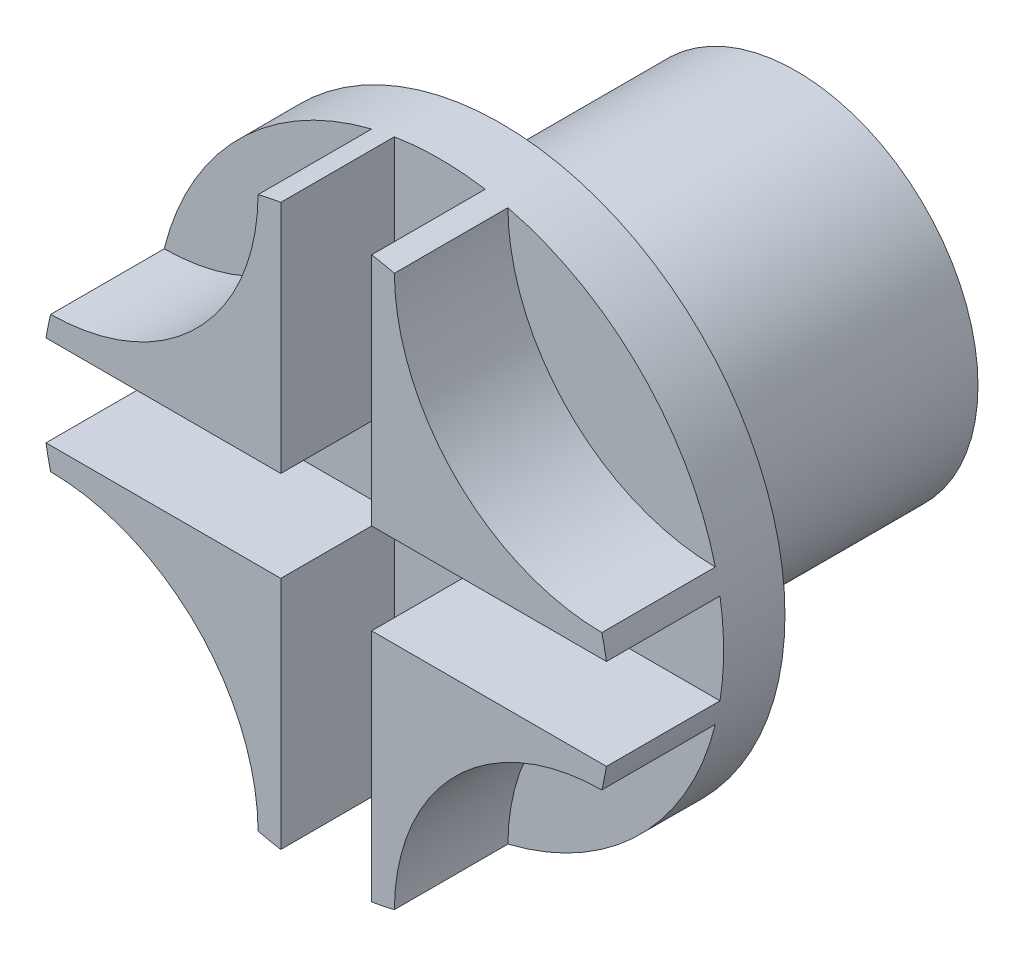
ISO-10303-21;
HEADER;
FILE_DESCRIPTION(('STEP AP214'),'2;1');
FILE_NAME('part.step','',(''),(''),'','','');
FILE_SCHEMA(('AUTOMOTIVE_DESIGN { 1 0 10303 214 1 1 1 1 }'));
ENDSEC;
DATA;
#1=APPLICATION_CONTEXT('core data for automotive mechanical design processes');
#2=APPLICATION_PROTOCOL_DEFINITION('international standard','automotive_design',2000,#1);
#3=PRODUCT_CONTEXT('',#1,'mechanical');
#4=PRODUCT('Part','Part','',(#3));
#5=PRODUCT_RELATED_PRODUCT_CATEGORY('part','',(#4));
#6=PRODUCT_DEFINITION_FORMATION('','',#4);
#7=PRODUCT_DEFINITION_CONTEXT('part definition',#1,'design');
#8=PRODUCT_DEFINITION('design','',#6,#7);
#9=PRODUCT_DEFINITION_SHAPE('','',#8);
#10=(LENGTH_UNIT() NAMED_UNIT(*) SI_UNIT(.MILLI.,.METRE.));
#11=(NAMED_UNIT(*) PLANE_ANGLE_UNIT() SI_UNIT($,.RADIAN.));
#12=(NAMED_UNIT(*) SI_UNIT($,.STERADIAN.) SOLID_ANGLE_UNIT());
#13=UNCERTAINTY_MEASURE_WITH_UNIT(LENGTH_MEASURE(1.E-05),#10,'distance_accuracy_value','');
#14=(GEOMETRIC_REPRESENTATION_CONTEXT(3) GLOBAL_UNCERTAINTY_ASSIGNED_CONTEXT((#13)) GLOBAL_UNIT_ASSIGNED_CONTEXT((#10,
#11,#12)) REPRESENTATION_CONTEXT('',''));
#15=CARTESIAN_POINT('',(0.,0.,0.));
#16=DIRECTION('',(0.,0.,1.));
#17=DIRECTION('',(1.,0.,0.));
#18=AXIS2_PLACEMENT_3D('',#15,#16,#17);
#19=CARTESIAN_POINT('',(0.,0.,2.7));
#20=DIRECTION('',(0.,0.,1.));
#21=DIRECTION('',(1.,0.,0.));
#22=AXIS2_PLACEMENT_3D('',#19,#20,#21);
#23=PLANE('',#22);
#24=DIRECTION('',(-1.,0.,0.));
#25=VECTOR('',#24,1.);
#26=CARTESIAN_POINT('',(0.,-2.,2.7));
#27=LINE('',#26,#25);
#28=CARTESIAN_POINT('',(-2.,-2.,2.7));
#29=VERTEX_POINT('',#28);
#30=CARTESIAN_POINT('',(-12.3389626792531,-2.,2.7));
#31=VERTEX_POINT('',#30);
#32=EDGE_CURVE('E49',#29,#31,#27,.T.);
#33=ORIENTED_EDGE('',*,*,#32,.F.);
#34=DIRECTION('',(0.,1.,0.));
#35=VECTOR('',#34,1.);
#36=CARTESIAN_POINT('',(-2.,0.,2.7));
#37=LINE('',#36,#35);
#38=CARTESIAN_POINT('',(-2.,-12.3389626792531,2.7));
#39=VERTEX_POINT('',#38);
#40=EDGE_CURVE('E205',#39,#29,#37,.T.);
#41=ORIENTED_EDGE('',*,*,#40,.F.);
#42=CARTESIAN_POINT('',(0.,0.,2.7));
#43=DIRECTION('',(0.,0.,1.));
#44=DIRECTION('',(1.,0.,0.));
#45=AXIS2_PLACEMENT_3D('',#42,#43,#44);
#46=CIRCLE('',#45,12.5);
#47=CARTESIAN_POINT('',(2.,-12.3389626792531,2.7));
#48=VERTEX_POINT('',#47);
#49=EDGE_CURVE('E316',#39,#48,#46,.T.);
#50=ORIENTED_EDGE('',*,*,#49,.T.);
#51=DIRECTION('',(0.,1.,0.));
#52=VECTOR('',#51,1.);
#53=CARTESIAN_POINT('',(2.,0.,2.7));
#54=LINE('',#53,#52);
#55=CARTESIAN_POINT('',(2.,-2.,2.7));
#56=VERTEX_POINT('',#55);
#57=EDGE_CURVE('E220',#48,#56,#54,.T.);
#58=ORIENTED_EDGE('',*,*,#57,.T.);
#59=DIRECTION('',(-1.,0.,0.));
#60=VECTOR('',#59,1.);
#61=CARTESIAN_POINT('',(0.,-2.,2.7));
#62=LINE('',#61,#60);
#63=CARTESIAN_POINT('',(12.3389626792531,-2.,2.7));
#64=VERTEX_POINT('',#63);
#65=EDGE_CURVE('E232',#64,#56,#62,.T.);
#66=ORIENTED_EDGE('',*,*,#65,.F.);
#67=CARTESIAN_POINT('',(12.3389626792531,2.,2.7));
#68=VERTEX_POINT('',#67);
#69=EDGE_CURVE('E325',#64,#68,#46,.T.);
#70=ORIENTED_EDGE('',*,*,#69,.T.);
#71=DIRECTION('',(1.,0.,0.));
#72=VECTOR('',#71,1.);
#73=CARTESIAN_POINT('',(0.,2.,2.7));
#74=LINE('',#73,#72);
#75=CARTESIAN_POINT('',(2.,2.,2.7));
#76=VERTEX_POINT('',#75);
#77=EDGE_CURVE('E254',#76,#68,#74,.T.);
#78=ORIENTED_EDGE('',*,*,#77,.F.);
#79=DIRECTION('',(0.,1.,0.));
#80=VECTOR('',#79,1.);
#81=CARTESIAN_POINT('',(2.,0.,2.7));
#82=LINE('',#81,#80);
#83=CARTESIAN_POINT('',(2.,12.3389626792531,2.7));
#84=VERTEX_POINT('',#83);
#85=EDGE_CURVE('E267',#76,#84,#82,.T.);
#86=ORIENTED_EDGE('',*,*,#85,.T.);
#87=CARTESIAN_POINT('',(-2.,12.3389626792531,2.7));
#88=VERTEX_POINT('',#87);
#89=EDGE_CURVE('E318',#84,#88,#46,.T.);
#90=ORIENTED_EDGE('',*,*,#89,.T.);
#91=DIRECTION('',(0.,1.,0.));
#92=VECTOR('',#91,1.);
#93=CARTESIAN_POINT('',(-2.,0.,2.7));
#94=LINE('',#93,#92);
#95=CARTESIAN_POINT('',(-2.,2.,2.7));
#96=VERTEX_POINT('',#95);
#97=EDGE_CURVE('E287',#96,#88,#94,.T.);
#98=ORIENTED_EDGE('',*,*,#97,.F.);
#99=DIRECTION('',(1.,0.,0.));
#100=VECTOR('',#99,1.);
#101=CARTESIAN_POINT('',(0.,2.,2.7));
#102=LINE('',#101,#100);
#103=CARTESIAN_POINT('',(-12.3389626792531,2.,2.7));
#104=VERTEX_POINT('',#103);
#105=EDGE_CURVE('E299',#104,#96,#102,.T.);
#106=ORIENTED_EDGE('',*,*,#105,.F.);
#107=EDGE_CURVE('E315',#104,#31,#46,.T.);
#108=ORIENTED_EDGE('',*,*,#107,.T.);
#109=EDGE_LOOP('',(#33,#41,#50,#58,#66,#70,#78,#86,#90,#98,#106,#108));
#110=FACE_BOUND('',#109,.T.);
#111=ADVANCED_FACE('F34',(#110),#23,.T.);
#112=CARTESIAN_POINT('',(-12.1997696102581,-12.1997696102581,2.7));
#113=DIRECTION('',(0.,0.,1.));
#114=DIRECTION('',(1.,0.,0.));
#115=AXIS2_PLACEMENT_3D('',#112,#113,#114);
#116=CIRCLE('',#115,9.2);
#117=CARTESIAN_POINT('',(-3.,-12.1346610995116,2.7));
#118=VERTEX_POINT('',#117);
#119=CARTESIAN_POINT('',(-12.1346610995116,-3.,2.7));
#120=VERTEX_POINT('',#119);
#121=EDGE_CURVE('E203',#118,#120,#116,.T.);
#122=ORIENTED_EDGE('',*,*,#121,.T.);
#123=EDGE_CURVE('E56',#120,#118,#46,.T.);
#124=ORIENTED_EDGE('',*,*,#123,.T.);
#125=EDGE_LOOP('',(#122,#124));
#126=FACE_BOUND('',#125,.T.);
#127=ADVANCED_FACE('F396',(#126),#23,.T.);
#128=CARTESIAN_POINT('',(12.1997696102581,12.1997696102581,2.7));
#129=DIRECTION('',(0.,0.,1.));
#130=DIRECTION('',(1.,0.,0.));
#131=AXIS2_PLACEMENT_3D('',#128,#129,#130);
#132=CIRCLE('',#131,9.2);
#133=CARTESIAN_POINT('',(3.,12.1346610995116,2.7));
#134=VERTEX_POINT('',#133);
#135=CARTESIAN_POINT('',(12.1346610995116,3.,2.7));
#136=VERTEX_POINT('',#135);
#137=EDGE_CURVE('E250',#134,#136,#132,.T.);
#138=ORIENTED_EDGE('',*,*,#137,.T.);
#139=EDGE_CURVE('E320',#136,#134,#46,.T.);
#140=ORIENTED_EDGE('',*,*,#139,.T.);
#141=EDGE_LOOP('',(#138,#140));
#142=FACE_BOUND('',#141,.T.);
#143=ADVANCED_FACE('F398',(#142),#23,.T.);
#144=CARTESIAN_POINT('',(-3.,12.1346610995116,2.7));
#145=VERTEX_POINT('',#144);
#146=CARTESIAN_POINT('',(-12.1346610995116,3.,2.7));
#147=VERTEX_POINT('',#146);
#148=EDGE_CURVE('E42',#145,#147,#46,.T.);
#149=ORIENTED_EDGE('',*,*,#148,.T.);
#150=CARTESIAN_POINT('',(-12.1997696102581,12.1997696102581,2.7));
#151=DIRECTION('',(0.,0.,1.));
#152=DIRECTION('',(1.,0.,0.));
#153=AXIS2_PLACEMENT_3D('',#150,#151,#152);
#154=CIRCLE('',#153,9.2);
#155=EDGE_CURVE('E283',#147,#145,#154,.T.);
#156=ORIENTED_EDGE('',*,*,#155,.T.);
#157=EDGE_LOOP('',(#149,#156));
#158=FACE_BOUND('',#157,.T.);
#159=ADVANCED_FACE('F387',(#158),#23,.T.);
#160=CARTESIAN_POINT('',(0.,0.,2.7));
#161=DIRECTION('',(0.,0.,-1.));
#162=DIRECTION('',(-1.,0.,0.));
#163=AXIS2_PLACEMENT_3D('',#160,#161,#162);
#164=CYLINDRICAL_SURFACE('',#163,12.5);
#165=ORIENTED_EDGE('',*,*,#148,.F.);
#166=DIRECTION('',(0.,0.,-1.));
#167=VECTOR('',#166,1.);
#168=CARTESIAN_POINT('',(-3.,12.1346610995116,7.7));
#169=LINE('',#168,#167);
#170=CARTESIAN_POINT('',(-3.,12.1346610995116,7.7));
#171=VERTEX_POINT('',#170);
#172=EDGE_CURVE('E312',#171,#145,#169,.T.);
#173=ORIENTED_EDGE('',*,*,#172,.F.);
#174=CARTESIAN_POINT('',(0.,0.,7.7));
#175=DIRECTION('',(0.,0.,1.));
#176=DIRECTION('',(1.,0.,0.));
#177=AXIS2_PLACEMENT_3D('',#174,#175,#176);
#178=CIRCLE('',#177,12.5);
#179=CARTESIAN_POINT('',(-2.,12.3389626792531,7.7));
#180=VERTEX_POINT('',#179);
#181=EDGE_CURVE('E284',#180,#171,#178,.T.);
#182=ORIENTED_EDGE('',*,*,#181,.F.);
#183=DIRECTION('',(0.,0.,-1.));
#184=VECTOR('',#183,1.);
#185=CARTESIAN_POINT('',(-2.,12.3389626792531,7.7));
#186=LINE('',#185,#184);
#187=EDGE_CURVE('E296',#180,#88,#186,.T.);
#188=ORIENTED_EDGE('',*,*,#187,.T.);
#189=ORIENTED_EDGE('',*,*,#89,.F.);
#190=DIRECTION('',(0.,0.,-1.));
#191=VECTOR('',#190,1.);
#192=CARTESIAN_POINT('',(2.,12.3389626792531,7.7));
#193=LINE('',#192,#191);
#194=CARTESIAN_POINT('',(2.,12.3389626792531,7.7));
#195=VERTEX_POINT('',#194);
#196=EDGE_CURVE('E277',#195,#84,#193,.T.);
#197=ORIENTED_EDGE('',*,*,#196,.F.);
#198=CARTESIAN_POINT('',(0.,0.,7.7));
#199=DIRECTION('',(0.,0.,1.));
#200=DIRECTION('',(1.,0.,0.));
#201=AXIS2_PLACEMENT_3D('',#198,#199,#200);
#202=CIRCLE('',#201,12.5);
#203=CARTESIAN_POINT('',(3.,12.1346610995116,7.7));
#204=VERTEX_POINT('',#203);
#205=EDGE_CURVE('E257',#204,#195,#202,.T.);
#206=ORIENTED_EDGE('',*,*,#205,.F.);
#207=DIRECTION('',(0.,0.,-1.));
#208=VECTOR('',#207,1.);
#209=CARTESIAN_POINT('',(3.,12.1346610995116,7.7));
#210=LINE('',#209,#208);
#211=EDGE_CURVE('E279',#204,#134,#210,.T.);
#212=ORIENTED_EDGE('',*,*,#211,.T.);
#213=ORIENTED_EDGE('',*,*,#139,.F.);
#214=DIRECTION('',(0.,0.,-1.));
#215=VECTOR('',#214,1.);
#216=CARTESIAN_POINT('',(12.1346610995116,3.,7.7));
#217=LINE('',#216,#215);
#218=CARTESIAN_POINT('',(12.1346610995116,3.,7.7));
#219=VERTEX_POINT('',#218);
#220=EDGE_CURVE('E281',#219,#136,#217,.T.);
#221=ORIENTED_EDGE('',*,*,#220,.F.);
#222=CARTESIAN_POINT('',(0.,0.,7.7));
#223=DIRECTION('',(0.,0.,1.));
#224=DIRECTION('',(1.,0.,0.));
#225=AXIS2_PLACEMENT_3D('',#222,#223,#224);
#226=CIRCLE('',#225,12.5);
#227=CARTESIAN_POINT('',(12.3389626792531,2.,7.7));
#228=VERTEX_POINT('',#227);
#229=EDGE_CURVE('E251',#228,#219,#226,.T.);
#230=ORIENTED_EDGE('',*,*,#229,.F.);
#231=DIRECTION('',(0.,0.,-1.));
#232=VECTOR('',#231,1.);
#233=CARTESIAN_POINT('',(12.3389626792531,2.,7.7));
#234=LINE('',#233,#232);
#235=EDGE_CURVE('E264',#228,#68,#234,.T.);
#236=ORIENTED_EDGE('',*,*,#235,.T.);
#237=ORIENTED_EDGE('',*,*,#69,.F.);
#238=DIRECTION('',(0.,0.,-1.));
#239=VECTOR('',#238,1.);
#240=CARTESIAN_POINT('',(12.3389626792531,-2.,7.7));
#241=LINE('',#240,#239);
#242=CARTESIAN_POINT('',(12.3389626792531,-2.,7.7));
#243=VERTEX_POINT('',#242);
#244=EDGE_CURVE('E241',#243,#64,#241,.T.);
#245=ORIENTED_EDGE('',*,*,#244,.F.);
#246=CARTESIAN_POINT('',(0.,0.,7.7));
#247=DIRECTION('',(0.,0.,1.));
#248=DIRECTION('',(1.,0.,0.));
#249=AXIS2_PLACEMENT_3D('',#246,#247,#248);
#250=CIRCLE('',#249,12.5);
#251=CARTESIAN_POINT('',(12.1346610995116,-3.,7.7));
#252=VERTEX_POINT('',#251);
#253=EDGE_CURVE('E223',#252,#243,#250,.T.);
#254=ORIENTED_EDGE('',*,*,#253,.F.);
#255=DIRECTION('',(0.,0.,-1.));
#256=VECTOR('',#255,1.);
#257=CARTESIAN_POINT('',(12.1346610995116,-3.,7.7));
#258=LINE('',#257,#256);
#259=CARTESIAN_POINT('',(12.1346610995116,-3.,2.7));
#260=VERTEX_POINT('',#259);
#261=EDGE_CURVE('E244',#252,#260,#258,.T.);
#262=ORIENTED_EDGE('',*,*,#261,.T.);
#263=CARTESIAN_POINT('',(3.,-12.1346610995116,2.7));
#264=VERTEX_POINT('',#263);
#265=EDGE_CURVE('E321',#264,#260,#46,.T.);
#266=ORIENTED_EDGE('',*,*,#265,.F.);
#267=DIRECTION('',(0.,0.,-1.));
#268=VECTOR('',#267,1.);
#269=CARTESIAN_POINT('',(3.,-12.1346610995116,7.7));
#270=LINE('',#269,#268);
#271=CARTESIAN_POINT('',(3.,-12.1346610995116,7.7));
#272=VERTEX_POINT('',#271);
#273=EDGE_CURVE('E247',#272,#264,#270,.T.);
#274=ORIENTED_EDGE('',*,*,#273,.F.);
#275=CARTESIAN_POINT('',(0.,0.,7.7));
#276=DIRECTION('',(0.,0.,1.));
#277=DIRECTION('',(1.,0.,0.));
#278=AXIS2_PLACEMENT_3D('',#275,#276,#277);
#279=CIRCLE('',#278,12.5);
#280=CARTESIAN_POINT('',(2.,-12.3389626792531,7.7));
#281=VERTEX_POINT('',#280);
#282=EDGE_CURVE('E217',#281,#272,#279,.T.);
#283=ORIENTED_EDGE('',*,*,#282,.F.);
#284=DIRECTION('',(0.,0.,-1.));
#285=VECTOR('',#284,1.);
#286=CARTESIAN_POINT('',(2.,-12.3389626792531,7.7));
#287=LINE('',#286,#285);
#288=EDGE_CURVE('E230',#281,#48,#287,.T.);
#289=ORIENTED_EDGE('',*,*,#288,.T.);
#290=ORIENTED_EDGE('',*,*,#49,.F.);
#291=DIRECTION('',(0.,0.,-1.));
#292=VECTOR('',#291,1.);
#293=CARTESIAN_POINT('',(-2.,-12.3389626792531,7.7));
#294=LINE('',#293,#292);
#295=CARTESIAN_POINT('',(-2.,-12.3389626792531,7.7));
#296=VERTEX_POINT('',#295);
#297=EDGE_CURVE('E213',#296,#39,#294,.T.);
#298=ORIENTED_EDGE('',*,*,#297,.F.);
#299=CARTESIAN_POINT('',(0.,0.,7.7));
#300=DIRECTION('',(0.,0.,1.));
#301=DIRECTION('',(1.,0.,0.));
#302=AXIS2_PLACEMENT_3D('',#299,#300,#301);
#303=CIRCLE('',#302,12.5);
#304=CARTESIAN_POINT('',(-3.,-12.1346610995116,7.7));
#305=VERTEX_POINT('',#304);
#306=EDGE_CURVE('E194',#305,#296,#303,.T.);
#307=ORIENTED_EDGE('',*,*,#306,.F.);
#308=DIRECTION('',(0.,0.,-1.));
#309=VECTOR('',#308,1.);
#310=CARTESIAN_POINT('',(-3.,-12.1346610995116,7.7));
#311=LINE('',#310,#309);
#312=EDGE_CURVE('E190',#305,#118,#311,.T.);
#313=ORIENTED_EDGE('',*,*,#312,.T.);
#314=ORIENTED_EDGE('',*,*,#123,.F.);
#315=DIRECTION('',(0.,0.,-1.));
#316=VECTOR('',#315,1.);
#317=CARTESIAN_POINT('',(-12.1346610995116,-3.,7.7));
#318=LINE('',#317,#316);
#319=CARTESIAN_POINT('',(-12.1346610995116,-3.,7.7));
#320=VERTEX_POINT('',#319);
#321=EDGE_CURVE('E184',#320,#120,#318,.T.);
#322=ORIENTED_EDGE('',*,*,#321,.F.);
#323=CARTESIAN_POINT('',(0.,0.,7.7));
#324=DIRECTION('',(0.,0.,1.));
#325=DIRECTION('',(1.,0.,0.));
#326=AXIS2_PLACEMENT_3D('',#323,#324,#325);
#327=CIRCLE('',#326,12.5);
#328=CARTESIAN_POINT('',(-12.3389626792531,-2.,7.7));
#329=VERTEX_POINT('',#328);
#330=EDGE_CURVE('E172',#329,#320,#327,.T.);
#331=ORIENTED_EDGE('',*,*,#330,.F.);
#332=DIRECTION('',(0.,0.,-1.));
#333=VECTOR('',#332,1.);
#334=CARTESIAN_POINT('',(-12.3389626792531,-2.,7.7));
#335=LINE('',#334,#333);
#336=EDGE_CURVE('E202',#329,#31,#335,.T.);
#337=ORIENTED_EDGE('',*,*,#336,.T.);
#338=ORIENTED_EDGE('',*,*,#107,.F.);
#339=DIRECTION('',(0.,0.,-1.));
#340=VECTOR('',#339,1.);
#341=CARTESIAN_POINT('',(-12.3389626792531,2.,7.7));
#342=LINE('',#341,#340);
#343=CARTESIAN_POINT('',(-12.3389626792531,2.,7.7));
#344=VERTEX_POINT('',#343);
#345=EDGE_CURVE('E308',#344,#104,#342,.T.);
#346=ORIENTED_EDGE('',*,*,#345,.F.);
#347=CARTESIAN_POINT('',(0.,0.,7.7));
#348=DIRECTION('',(0.,0.,1.));
#349=DIRECTION('',(1.,0.,0.));
#350=AXIS2_PLACEMENT_3D('',#347,#348,#349);
#351=CIRCLE('',#350,12.5);
#352=CARTESIAN_POINT('',(-12.1346610995116,3.,7.7));
#353=VERTEX_POINT('',#352);
#354=EDGE_CURVE('E290',#353,#344,#351,.T.);
#355=ORIENTED_EDGE('',*,*,#354,.F.);
#356=DIRECTION('',(0.,0.,-1.));
#357=VECTOR('',#356,1.);
#358=CARTESIAN_POINT('',(-12.1346610995116,3.,7.7));
#359=LINE('',#358,#357);
#360=EDGE_CURVE('E310',#353,#147,#359,.T.);
#361=ORIENTED_EDGE('',*,*,#360,.T.);
#362=EDGE_LOOP('',(#165,#173,#182,#188,#189,#197,#206,#212,#213,#221,#230,#236,#237,#245,#254,
#262,#266,#274,#283,#289,#290,#298,#307,#313,#314,#322,#331,#337,#338,#346,#355,#361));
#363=FACE_BOUND('',#362,.T.);
#364=CARTESIAN_POINT('',(0.,0.,0.));
#365=DIRECTION('',(0.,0.,1.));
#366=DIRECTION('',(1.,0.,0.));
#367=AXIS2_PLACEMENT_3D('',#364,#365,#366);
#368=CIRCLE('',#367,12.5);
#369=CARTESIAN_POINT('',(12.5,0.,0.));
#370=VERTEX_POINT('',#369);
#371=EDGE_CURVE('E314',#370,#370,#368,.T.);
#372=ORIENTED_EDGE('',*,*,#371,.T.);
#373=EDGE_LOOP('',(#372));
#374=FACE_BOUND('',#373,.T.);
#375=ADVANCED_FACE('F36',(#363,#374),#164,.T.);
#376=CARTESIAN_POINT('',(12.1997696102581,-12.1997696102581,2.7));
#377=DIRECTION('',(0.,0.,1.));
#378=DIRECTION('',(1.,0.,0.));
#379=AXIS2_PLACEMENT_3D('',#376,#377,#378);
#380=CIRCLE('',#379,9.2);
#381=EDGE_CURVE('E189',#260,#264,#380,.T.);
#382=ORIENTED_EDGE('',*,*,#381,.T.);
#383=ORIENTED_EDGE('',*,*,#265,.T.);
#384=EDGE_LOOP('',(#382,#383));
#385=FACE_BOUND('',#384,.T.);
#386=ADVANCED_FACE('F383',(#385),#23,.T.);
#387=CARTESIAN_POINT('',(0.,0.,0.));
#388=DIRECTION('',(0.,0.,1.));
#389=DIRECTION('',(1.,0.,0.));
#390=AXIS2_PLACEMENT_3D('',#387,#388,#389);
#391=PLANE('',#390);
#392=CARTESIAN_POINT('',(0.,0.,0.));
#393=DIRECTION('',(0.,0.,1.));
#394=DIRECTION('',(1.,0.,0.));
#395=AXIS2_PLACEMENT_3D('',#392,#393,#394);
#396=CIRCLE('',#395,8.);
#397=CARTESIAN_POINT('',(8.,0.,0.));
#398=VERTEX_POINT('',#397);
#399=EDGE_CURVE('E11',#398,#398,#396,.F.);
#400=ORIENTED_EDGE('',*,*,#399,.F.);
#401=EDGE_LOOP('',(#400));
#402=FACE_BOUND('',#401,.T.);
#403=ORIENTED_EDGE('',*,*,#371,.F.);
#404=EDGE_LOOP('',(#403));
#405=FACE_BOUND('',#404,.T.);
#406=ADVANCED_FACE('F385',(#402,#405),#391,.F.);
#407=CARTESIAN_POINT('',(-12.1997696102581,12.1997696102581,7.7));
#408=DIRECTION('',(0.,0.,-1.));
#409=DIRECTION('',(-1.,0.,0.));
#410=AXIS2_PLACEMENT_3D('',#407,#408,#409);
#411=CYLINDRICAL_SURFACE('',#410,9.2);
#412=ORIENTED_EDGE('',*,*,#155,.F.);
#413=ORIENTED_EDGE('',*,*,#360,.F.);
#414=CARTESIAN_POINT('',(-12.1997696102581,12.1997696102581,7.7));
#415=DIRECTION('',(0.,0.,1.));
#416=DIRECTION('',(1.,0.,0.));
#417=AXIS2_PLACEMENT_3D('',#414,#415,#416);
#418=CIRCLE('',#417,9.2);
#419=EDGE_CURVE('E286',#353,#171,#418,.T.);
#420=ORIENTED_EDGE('',*,*,#419,.T.);
#421=ORIENTED_EDGE('',*,*,#172,.T.);
#422=EDGE_LOOP('',(#412,#413,#420,#421));
#423=FACE_BOUND('',#422,.T.);
#424=ADVANCED_FACE('F392',(#423),#411,.F.);
#425=CARTESIAN_POINT('',(0.,2.,7.7));
#426=DIRECTION('',(0.,1.,0.));
#427=DIRECTION('',(-1.,0.,0.));
#428=AXIS2_PLACEMENT_3D('',#425,#426,#427);
#429=PLANE('',#428);
#430=ORIENTED_EDGE('',*,*,#105,.T.);
#431=DIRECTION('',(0.,0.,-1.));
#432=VECTOR('',#431,1.);
#433=CARTESIAN_POINT('',(-2.,2.,7.7));
#434=LINE('',#433,#432);
#435=CARTESIAN_POINT('',(-2.,2.,7.7));
#436=VERTEX_POINT('',#435);
#437=EDGE_CURVE('E305',#436,#96,#434,.T.);
#438=ORIENTED_EDGE('',*,*,#437,.F.);
#439=DIRECTION('',(1.,0.,0.));
#440=VECTOR('',#439,1.);
#441=CARTESIAN_POINT('',(0.,2.,7.7));
#442=LINE('',#441,#440);
#443=EDGE_CURVE('E292',#344,#436,#442,.T.);
#444=ORIENTED_EDGE('',*,*,#443,.F.);
#445=ORIENTED_EDGE('',*,*,#345,.T.);
#446=EDGE_LOOP('',(#430,#438,#444,#445));
#447=FACE_BOUND('',#446,.T.);
#448=ADVANCED_FACE('F410',(#447),#429,.F.);
#449=CARTESIAN_POINT('',(-2.,0.,7.7));
#450=DIRECTION('',(-1.,0.,0.));
#451=DIRECTION('',(0.,0.,1.));
#452=AXIS2_PLACEMENT_3D('',#449,#450,#451);
#453=PLANE('',#452);
#454=ORIENTED_EDGE('',*,*,#97,.T.);
#455=ORIENTED_EDGE('',*,*,#187,.F.);
#456=DIRECTION('',(0.,1.,0.));
#457=VECTOR('',#456,1.);
#458=CARTESIAN_POINT('',(-2.,0.,7.7));
#459=LINE('',#458,#457);
#460=EDGE_CURVE('E294',#436,#180,#459,.T.);
#461=ORIENTED_EDGE('',*,*,#460,.F.);
#462=ORIENTED_EDGE('',*,*,#437,.T.);
#463=EDGE_LOOP('',(#454,#455,#461,#462));
#464=FACE_BOUND('',#463,.T.);
#465=ADVANCED_FACE('F351',(#464),#453,.F.);
#466=CARTESIAN_POINT('',(0.,0.,7.7));
#467=DIRECTION('',(0.,0.,1.));
#468=DIRECTION('',(1.,0.,0.));
#469=AXIS2_PLACEMENT_3D('',#466,#467,#468);
#470=PLANE('',#469);
#471=ORIENTED_EDGE('',*,*,#181,.T.);
#472=ORIENTED_EDGE('',*,*,#419,.F.);
#473=ORIENTED_EDGE('',*,*,#354,.T.);
#474=ORIENTED_EDGE('',*,*,#443,.T.);
#475=ORIENTED_EDGE('',*,*,#460,.T.);
#476=EDGE_LOOP('',(#471,#472,#473,#474,#475));
#477=FACE_BOUND('',#476,.T.);
#478=ADVANCED_FACE('F409',(#477),#470,.T.);
#479=CARTESIAN_POINT('',(12.1997696102581,12.1997696102581,7.7));
#480=DIRECTION('',(0.,0.,-1.));
#481=DIRECTION('',(-1.,0.,0.));
#482=AXIS2_PLACEMENT_3D('',#479,#480,#481);
#483=CYLINDRICAL_SURFACE('',#482,9.2);
#484=ORIENTED_EDGE('',*,*,#137,.F.);
#485=ORIENTED_EDGE('',*,*,#211,.F.);
#486=CARTESIAN_POINT('',(12.1997696102581,12.1997696102581,7.7));
#487=DIRECTION('',(0.,0.,1.));
#488=DIRECTION('',(1.,0.,0.));
#489=AXIS2_PLACEMENT_3D('',#486,#487,#488);
#490=CIRCLE('',#489,9.2);
#491=EDGE_CURVE('E253',#204,#219,#490,.T.);
#492=ORIENTED_EDGE('',*,*,#491,.T.);
#493=ORIENTED_EDGE('',*,*,#220,.T.);
#494=EDGE_LOOP('',(#484,#485,#492,#493));
#495=FACE_BOUND('',#494,.T.);
#496=ADVANCED_FACE('F421',(#495),#483,.F.);
#497=CARTESIAN_POINT('',(2.,0.,7.7));
#498=DIRECTION('',(-1.,0.,0.));
#499=DIRECTION('',(0.,0.,1.));
#500=AXIS2_PLACEMENT_3D('',#497,#498,#499);
#501=PLANE('',#500);
#502=ORIENTED_EDGE('',*,*,#85,.F.);
#503=DIRECTION('',(0.,0.,-1.));
#504=VECTOR('',#503,1.);
#505=CARTESIAN_POINT('',(2.,2.,7.7));
#506=LINE('',#505,#504);
#507=CARTESIAN_POINT('',(2.,2.,7.7));
#508=VERTEX_POINT('',#507);
#509=EDGE_CURVE('E274',#508,#76,#506,.T.);
#510=ORIENTED_EDGE('',*,*,#509,.F.);
#511=DIRECTION('',(0.,1.,0.));
#512=VECTOR('',#511,1.);
#513=CARTESIAN_POINT('',(2.,0.,7.7));
#514=LINE('',#513,#512);
#515=EDGE_CURVE('E259',#508,#195,#514,.T.);
#516=ORIENTED_EDGE('',*,*,#515,.T.);
#517=ORIENTED_EDGE('',*,*,#196,.T.);
#518=EDGE_LOOP('',(#502,#510,#516,#517));
#519=FACE_BOUND('',#518,.T.);
#520=ADVANCED_FACE('F345',(#519),#501,.T.);
#521=CARTESIAN_POINT('',(0.,2.,7.7));
#522=DIRECTION('',(0.,1.,0.));
#523=DIRECTION('',(-1.,0.,0.));
#524=AXIS2_PLACEMENT_3D('',#521,#522,#523);
#525=PLANE('',#524);
#526=ORIENTED_EDGE('',*,*,#77,.T.);
#527=ORIENTED_EDGE('',*,*,#235,.F.);
#528=DIRECTION('',(1.,0.,0.));
#529=VECTOR('',#528,1.);
#530=CARTESIAN_POINT('',(0.,2.,7.7));
#531=LINE('',#530,#529);
#532=EDGE_CURVE('E262',#508,#228,#531,.T.);
#533=ORIENTED_EDGE('',*,*,#532,.F.);
#534=ORIENTED_EDGE('',*,*,#509,.T.);
#535=EDGE_LOOP('',(#526,#527,#533,#534));
#536=FACE_BOUND('',#535,.T.);
#537=ADVANCED_FACE('F333',(#536),#525,.F.);
#538=CARTESIAN_POINT('',(0.,0.,7.7));
#539=DIRECTION('',(0.,0.,1.));
#540=DIRECTION('',(1.,0.,0.));
#541=AXIS2_PLACEMENT_3D('',#538,#539,#540);
#542=PLANE('',#541);
#543=ORIENTED_EDGE('',*,*,#229,.T.);
#544=ORIENTED_EDGE('',*,*,#491,.F.);
#545=ORIENTED_EDGE('',*,*,#205,.T.);
#546=ORIENTED_EDGE('',*,*,#515,.F.);
#547=ORIENTED_EDGE('',*,*,#532,.T.);
#548=EDGE_LOOP('',(#543,#544,#545,#546,#547));
#549=FACE_BOUND('',#548,.T.);
#550=ADVANCED_FACE('F340',(#549),#542,.T.);
#551=CARTESIAN_POINT('',(12.1997696102581,-12.1997696102581,7.7));
#552=DIRECTION('',(0.,0.,-1.));
#553=DIRECTION('',(-1.,0.,0.));
#554=AXIS2_PLACEMENT_3D('',#551,#552,#553);
#555=CYLINDRICAL_SURFACE('',#554,9.2);
#556=ORIENTED_EDGE('',*,*,#381,.F.);
#557=ORIENTED_EDGE('',*,*,#261,.F.);
#558=CARTESIAN_POINT('',(12.1997696102581,-12.1997696102581,7.7));
#559=DIRECTION('',(0.,0.,1.));
#560=DIRECTION('',(1.,0.,0.));
#561=AXIS2_PLACEMENT_3D('',#558,#559,#560);
#562=CIRCLE('',#561,9.2);
#563=EDGE_CURVE('E219',#252,#272,#562,.T.);
#564=ORIENTED_EDGE('',*,*,#563,.T.);
#565=ORIENTED_EDGE('',*,*,#273,.T.);
#566=EDGE_LOOP('',(#556,#557,#564,#565));
#567=FACE_BOUND('',#566,.T.);
#568=ADVANCED_FACE('F382',(#567),#555,.F.);
#569=CARTESIAN_POINT('',(0.,-2.,7.7));
#570=DIRECTION('',(0.,-1.,0.));
#571=DIRECTION('',(1.,0.,0.));
#572=AXIS2_PLACEMENT_3D('',#569,#570,#571);
#573=PLANE('',#572);
#574=ORIENTED_EDGE('',*,*,#65,.T.);
#575=DIRECTION('',(0.,0.,-1.));
#576=VECTOR('',#575,1.);
#577=CARTESIAN_POINT('',(2.,-2.,7.7));
#578=LINE('',#577,#576);
#579=CARTESIAN_POINT('',(2.,-2.,7.7));
#580=VERTEX_POINT('',#579);
#581=EDGE_CURVE('E238',#580,#56,#578,.T.);
#582=ORIENTED_EDGE('',*,*,#581,.F.);
#583=DIRECTION('',(-1.,0.,0.));
#584=VECTOR('',#583,1.);
#585=CARTESIAN_POINT('',(0.,-2.,7.7));
#586=LINE('',#585,#584);
#587=EDGE_CURVE('E225',#243,#580,#586,.T.);
#588=ORIENTED_EDGE('',*,*,#587,.F.);
#589=ORIENTED_EDGE('',*,*,#244,.T.);
#590=EDGE_LOOP('',(#574,#582,#588,#589));
#591=FACE_BOUND('',#590,.T.);
#592=ADVANCED_FACE('F375',(#591),#573,.F.);
#593=CARTESIAN_POINT('',(2.,0.,7.7));
#594=DIRECTION('',(-1.,0.,0.));
#595=DIRECTION('',(0.,0.,1.));
#596=AXIS2_PLACEMENT_3D('',#593,#594,#595);
#597=PLANE('',#596);
#598=ORIENTED_EDGE('',*,*,#57,.F.);
#599=ORIENTED_EDGE('',*,*,#288,.F.);
#600=DIRECTION('',(0.,1.,0.));
#601=VECTOR('',#600,1.);
#602=CARTESIAN_POINT('',(2.,0.,7.7));
#603=LINE('',#602,#601);
#604=EDGE_CURVE('E227',#281,#580,#603,.T.);
#605=ORIENTED_EDGE('',*,*,#604,.T.);
#606=ORIENTED_EDGE('',*,*,#581,.T.);
#607=EDGE_LOOP('',(#598,#599,#605,#606));
#608=FACE_BOUND('',#607,.T.);
#609=ADVANCED_FACE('F371',(#608),#597,.T.);
#610=CARTESIAN_POINT('',(0.,0.,7.7));
#611=DIRECTION('',(0.,0.,1.));
#612=DIRECTION('',(1.,0.,0.));
#613=AXIS2_PLACEMENT_3D('',#610,#611,#612);
#614=PLANE('',#613);
#615=ORIENTED_EDGE('',*,*,#282,.T.);
#616=ORIENTED_EDGE('',*,*,#563,.F.);
#617=ORIENTED_EDGE('',*,*,#253,.T.);
#618=ORIENTED_EDGE('',*,*,#587,.T.);
#619=ORIENTED_EDGE('',*,*,#604,.F.);
#620=EDGE_LOOP('',(#615,#616,#617,#618,#619));
#621=FACE_BOUND('',#620,.T.);
#622=ADVANCED_FACE('F380',(#621),#614,.T.);
#623=CARTESIAN_POINT('',(-12.1997696102581,-12.1997696102581,7.7));
#624=DIRECTION('',(0.,0.,-1.));
#625=DIRECTION('',(-1.,0.,0.));
#626=AXIS2_PLACEMENT_3D('',#623,#624,#625);
#627=CYLINDRICAL_SURFACE('',#626,9.2);
#628=ORIENTED_EDGE('',*,*,#121,.F.);
#629=ORIENTED_EDGE('',*,*,#312,.F.);
#630=CARTESIAN_POINT('',(-12.1997696102581,-12.1997696102581,7.7));
#631=DIRECTION('',(0.,0.,1.));
#632=DIRECTION('',(1.,0.,0.));
#633=AXIS2_PLACEMENT_3D('',#630,#631,#632);
#634=CIRCLE('',#633,9.2);
#635=EDGE_CURVE('E176',#305,#320,#634,.T.);
#636=ORIENTED_EDGE('',*,*,#635,.T.);
#637=ORIENTED_EDGE('',*,*,#321,.T.);
#638=EDGE_LOOP('',(#628,#629,#636,#637));
#639=FACE_BOUND('',#638,.T.);
#640=ADVANCED_FACE('F192',(#639),#627,.F.);
#641=CARTESIAN_POINT('',(-2.,0.,7.7));
#642=DIRECTION('',(-1.,0.,0.));
#643=DIRECTION('',(0.,0.,1.));
#644=AXIS2_PLACEMENT_3D('',#641,#642,#643);
#645=PLANE('',#644);
#646=ORIENTED_EDGE('',*,*,#40,.T.);
#647=DIRECTION('',(0.,0.,-1.));
#648=VECTOR('',#647,1.);
#649=CARTESIAN_POINT('',(-2.,-2.,7.7));
#650=LINE('',#649,#648);
#651=CARTESIAN_POINT('',(-2.,-2.,7.7));
#652=VERTEX_POINT('',#651);
#653=EDGE_CURVE('E210',#652,#29,#650,.T.);
#654=ORIENTED_EDGE('',*,*,#653,.F.);
#655=DIRECTION('',(0.,1.,0.));
#656=VECTOR('',#655,1.);
#657=CARTESIAN_POINT('',(-2.,0.,7.7));
#658=LINE('',#657,#656);
#659=EDGE_CURVE('E196',#296,#652,#658,.T.);
#660=ORIENTED_EDGE('',*,*,#659,.F.);
#661=ORIENTED_EDGE('',*,*,#297,.T.);
#662=EDGE_LOOP('',(#646,#654,#660,#661));
#663=FACE_BOUND('',#662,.T.);
#664=ADVANCED_FACE('F364',(#663),#645,.F.);
#665=CARTESIAN_POINT('',(0.,-2.,7.7));
#666=DIRECTION('',(0.,-1.,0.));
#667=DIRECTION('',(1.,0.,0.));
#668=AXIS2_PLACEMENT_3D('',#665,#666,#667);
#669=PLANE('',#668);
#670=ORIENTED_EDGE('',*,*,#32,.T.);
#671=ORIENTED_EDGE('',*,*,#336,.F.);
#672=DIRECTION('',(-1.,0.,0.));
#673=VECTOR('',#672,1.);
#674=CARTESIAN_POINT('',(0.,-2.,7.7));
#675=LINE('',#674,#673);
#676=EDGE_CURVE('E178',#652,#329,#675,.T.);
#677=ORIENTED_EDGE('',*,*,#676,.F.);
#678=ORIENTED_EDGE('',*,*,#653,.T.);
#679=EDGE_LOOP('',(#670,#671,#677,#678));
#680=FACE_BOUND('',#679,.T.);
#681=ADVANCED_FACE('F360',(#680),#669,.F.);
#682=CARTESIAN_POINT('',(0.,0.,7.7));
#683=DIRECTION('',(0.,0.,1.));
#684=DIRECTION('',(1.,0.,0.));
#685=AXIS2_PLACEMENT_3D('',#682,#683,#684);
#686=PLANE('',#685);
#687=ORIENTED_EDGE('',*,*,#330,.T.);
#688=ORIENTED_EDGE('',*,*,#635,.F.);
#689=ORIENTED_EDGE('',*,*,#306,.T.);
#690=ORIENTED_EDGE('',*,*,#659,.T.);
#691=ORIENTED_EDGE('',*,*,#676,.T.);
#692=EDGE_LOOP('',(#687,#688,#689,#690,#691));
#693=FACE_BOUND('',#692,.T.);
#694=ADVANCED_FACE('F174',(#693),#686,.T.);
#695=CARTESIAN_POINT('',(0.,0.,-13.));
#696=DIRECTION('',(0.,0.,1.));
#697=DIRECTION('',(1.,0.,0.));
#698=AXIS2_PLACEMENT_3D('',#695,#696,#697);
#699=CYLINDRICAL_SURFACE('',#698,8.);
#700=CARTESIAN_POINT('',(0.,0.,-13.));
#701=DIRECTION('',(0.,0.,-1.));
#702=DIRECTION('',(-1.,0.,0.));
#703=AXIS2_PLACEMENT_3D('',#700,#701,#702);
#704=CIRCLE('',#703,8.);
#705=CARTESIAN_POINT('',(-8.,0.,-13.));
#706=VERTEX_POINT('',#705);
#707=EDGE_CURVE('E206',#706,#706,#704,.T.);
#708=ORIENTED_EDGE('',*,*,#707,.F.);
#709=EDGE_LOOP('',(#708));
#710=FACE_BOUND('',#709,.T.);
#711=ORIENTED_EDGE('',*,*,#399,.T.);
#712=EDGE_LOOP('',(#711));
#713=FACE_BOUND('',#712,.T.);
#714=ADVANCED_FACE('F447',(#710,#713),#699,.T.);
#715=CARTESIAN_POINT('',(0.,0.,-13.));
#716=DIRECTION('',(0.,0.,-1.));
#717=DIRECTION('',(-1.,0.,0.));
#718=AXIS2_PLACEMENT_3D('',#715,#716,#717);
#719=PLANE('',#718);
#720=ORIENTED_EDGE('',*,*,#707,.T.);
#721=EDGE_LOOP('',(#720));
#722=FACE_BOUND('',#721,.T.);
#723=ADVANCED_FACE('F450',(#722),#719,.T.);
#724=CLOSED_SHELL('',(#111,#127,#143,#159,#375,#386,#406,#424,#448,#465,#478,#496,#520,#537,
#550,#568,#592,#609,#622,#640,#664,#681,#694,#714,#723));
#725=MANIFOLD_SOLID_BREP('B2',#724);
#726=ADVANCED_BREP_SHAPE_REPRESENTATION('',(#18,#725),#14);
#727=SHAPE_DEFINITION_REPRESENTATION(#9,#726);
ENDSEC;
END-ISO-10303-21;
